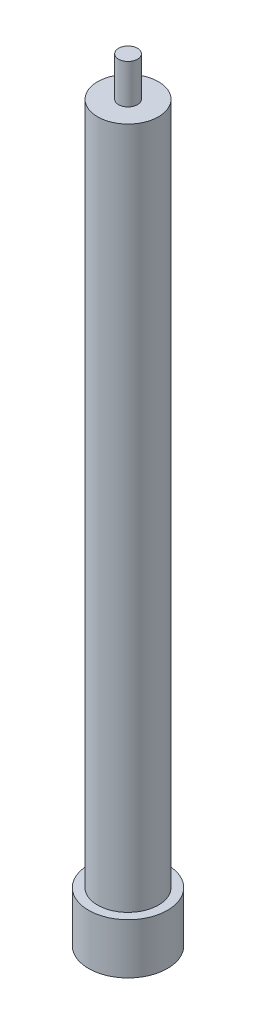
ISO-10303-21;
HEADER;
FILE_DESCRIPTION(('STEP AP214'),'2;1');
FILE_NAME('part.step','',(''),(''),'','','');
FILE_SCHEMA(('AUTOMOTIVE_DESIGN { 1 0 10303 214 1 1 1 1 }'));
ENDSEC;
DATA;
#1=APPLICATION_CONTEXT('core data for automotive mechanical design processes');
#2=APPLICATION_PROTOCOL_DEFINITION('international standard','automotive_design',2000,#1);
#3=PRODUCT_CONTEXT('',#1,'mechanical');
#4=PRODUCT('Part','Part','',(#3));
#5=PRODUCT_RELATED_PRODUCT_CATEGORY('part','',(#4));
#6=PRODUCT_DEFINITION_FORMATION('','',#4);
#7=PRODUCT_DEFINITION_CONTEXT('part definition',#1,'design');
#8=PRODUCT_DEFINITION('design','',#6,#7);
#9=PRODUCT_DEFINITION_SHAPE('','',#8);
#10=(LENGTH_UNIT() NAMED_UNIT(*) SI_UNIT(.MILLI.,.METRE.));
#11=(NAMED_UNIT(*) PLANE_ANGLE_UNIT() SI_UNIT($,.RADIAN.));
#12=(NAMED_UNIT(*) SI_UNIT($,.STERADIAN.) SOLID_ANGLE_UNIT());
#13=UNCERTAINTY_MEASURE_WITH_UNIT(LENGTH_MEASURE(1.E-05),#10,'distance_accuracy_value','');
#14=(GEOMETRIC_REPRESENTATION_CONTEXT(3) GLOBAL_UNCERTAINTY_ASSIGNED_CONTEXT((#13)) GLOBAL_UNIT_ASSIGNED_CONTEXT((#10,
#11,#12)) REPRESENTATION_CONTEXT('',''));
#15=CARTESIAN_POINT('',(0.,0.,0.));
#16=DIRECTION('',(0.,0.,1.));
#17=DIRECTION('',(1.,0.,0.));
#18=AXIS2_PLACEMENT_3D('',#15,#16,#17);
#19=CARTESIAN_POINT('',(0.,590.55,0.));
#20=DIRECTION('',(0.,-1.,0.));
#21=DIRECTION('',(0.,0.,-1.));
#22=AXIS2_PLACEMENT_3D('',#19,#20,#21);
#23=CYLINDRICAL_SURFACE('',#22,24.511);
#24=CARTESIAN_POINT('',(0.,590.55,0.));
#25=DIRECTION('',(0.,-1.,0.));
#26=DIRECTION('',(0.,0.,-1.));
#27=AXIS2_PLACEMENT_3D('',#24,#25,#26);
#28=CIRCLE('',#27,24.511);
#29=CARTESIAN_POINT('',(0.,590.55,-24.511));
#30=VERTEX_POINT('',#29);
#31=EDGE_CURVE('E51',#30,#30,#28,.T.);
#32=ORIENTED_EDGE('',*,*,#31,.T.);
#33=EDGE_LOOP('',(#32));
#34=FACE_BOUND('',#33,.T.);
#35=CARTESIAN_POINT('',(0.,40.64,0.));
#36=DIRECTION('',(0.,-1.,0.));
#37=DIRECTION('',(0.,0.,-1.));
#38=AXIS2_PLACEMENT_3D('',#35,#36,#37);
#39=CIRCLE('',#38,24.511);
#40=CARTESIAN_POINT('',(0.,40.64,-24.511));
#41=VERTEX_POINT('',#40);
#42=EDGE_CURVE('E41',#41,#41,#39,.F.);
#43=ORIENTED_EDGE('',*,*,#42,.T.);
#44=EDGE_LOOP('',(#43));
#45=FACE_BOUND('',#44,.T.);
#46=ADVANCED_FACE('F37',(#34,#45),#23,.T.);
#47=CARTESIAN_POINT('',(0.,622.3,0.));
#48=DIRECTION('',(0.,-1.,0.));
#49=DIRECTION('',(0.,0.,-1.));
#50=AXIS2_PLACEMENT_3D('',#47,#48,#49);
#51=CYLINDRICAL_SURFACE('',#50,7.62);
#52=CARTESIAN_POINT('',(0.,622.3,0.));
#53=DIRECTION('',(0.,1.,0.));
#54=DIRECTION('',(0.,0.,1.));
#55=AXIS2_PLACEMENT_3D('',#52,#53,#54);
#56=CIRCLE('',#55,7.62);
#57=CARTESIAN_POINT('',(0.,622.3,7.62));
#58=VERTEX_POINT('',#57);
#59=EDGE_CURVE('E46',#58,#58,#56,.T.);
#60=ORIENTED_EDGE('',*,*,#59,.F.);
#61=EDGE_LOOP('',(#60));
#62=FACE_BOUND('',#61,.T.);
#63=CARTESIAN_POINT('',(0.,590.55,0.));
#64=DIRECTION('',(0.,-1.,0.));
#65=DIRECTION('',(0.,0.,-1.));
#66=AXIS2_PLACEMENT_3D('',#63,#64,#65);
#67=CIRCLE('',#66,7.62);
#68=CARTESIAN_POINT('',(0.,590.55,-7.62));
#69=VERTEX_POINT('',#68);
#70=EDGE_CURVE('E10',#69,#69,#67,.T.);
#71=ORIENTED_EDGE('',*,*,#70,.F.);
#72=EDGE_LOOP('',(#71));
#73=FACE_BOUND('',#72,.T.);
#74=ADVANCED_FACE('F39',(#62,#73),#51,.T.);
#75=CARTESIAN_POINT('',(0.,622.3,0.));
#76=DIRECTION('',(0.,1.,0.));
#77=DIRECTION('',(0.,0.,1.));
#78=AXIS2_PLACEMENT_3D('',#75,#76,#77);
#79=PLANE('',#78);
#80=ORIENTED_EDGE('',*,*,#59,.T.);
#81=EDGE_LOOP('',(#80));
#82=FACE_BOUND('',#81,.T.);
#83=ADVANCED_FACE('F90',(#82),#79,.T.);
#84=CARTESIAN_POINT('',(0.,590.55,0.));
#85=DIRECTION('',(0.,-1.,0.));
#86=DIRECTION('',(0.,0.,-1.));
#87=AXIS2_PLACEMENT_3D('',#84,#85,#86);
#88=PLANE('',#87);
#89=ORIENTED_EDGE('',*,*,#70,.T.);
#90=EDGE_LOOP('',(#89));
#91=FACE_BOUND('',#90,.T.);
#92=ORIENTED_EDGE('',*,*,#31,.F.);
#93=EDGE_LOOP('',(#92));
#94=FACE_BOUND('',#93,.T.);
#95=ADVANCED_FACE('F82',(#91,#94),#88,.F.);
#96=CARTESIAN_POINT('',(0.,40.64,0.));
#97=DIRECTION('',(0.,-1.,0.));
#98=DIRECTION('',(0.,0.,-1.));
#99=AXIS2_PLACEMENT_3D('',#96,#97,#98);
#100=CYLINDRICAL_SURFACE('',#99,31.75);
#101=CARTESIAN_POINT('',(0.,40.64,0.));
#102=DIRECTION('',(0.,-1.,0.));
#103=DIRECTION('',(0.,0.,-1.));
#104=AXIS2_PLACEMENT_3D('',#101,#102,#103);
#105=CIRCLE('',#104,31.75);
#106=CARTESIAN_POINT('',(0.,40.64,-31.75));
#107=VERTEX_POINT('',#106);
#108=EDGE_CURVE('E61',#107,#107,#105,.T.);
#109=ORIENTED_EDGE('',*,*,#108,.T.);
#110=EDGE_LOOP('',(#109));
#111=FACE_BOUND('',#110,.T.);
#112=CARTESIAN_POINT('',(0.,0.,0.));
#113=DIRECTION('',(0.,-1.,0.));
#114=DIRECTION('',(0.,0.,-1.));
#115=AXIS2_PLACEMENT_3D('',#112,#113,#114);
#116=CIRCLE('',#115,31.75);
#117=CARTESIAN_POINT('',(0.,0.,-31.75));
#118=VERTEX_POINT('',#117);
#119=EDGE_CURVE('E57',#118,#118,#116,.T.);
#120=ORIENTED_EDGE('',*,*,#119,.F.);
#121=EDGE_LOOP('',(#120));
#122=FACE_BOUND('',#121,.T.);
#123=ADVANCED_FACE('F75',(#111,#122),#100,.T.);
#124=CARTESIAN_POINT('',(0.,40.64,0.));
#125=DIRECTION('',(0.,-1.,0.));
#126=DIRECTION('',(0.,0.,-1.));
#127=AXIS2_PLACEMENT_3D('',#124,#125,#126);
#128=PLANE('',#127);
#129=ORIENTED_EDGE('',*,*,#42,.F.);
#130=EDGE_LOOP('',(#129));
#131=FACE_BOUND('',#130,.T.);
#132=ORIENTED_EDGE('',*,*,#108,.F.);
#133=EDGE_LOOP('',(#132));
#134=FACE_BOUND('',#133,.T.);
#135=ADVANCED_FACE('F71',(#131,#134),#128,.F.);
#136=CARTESIAN_POINT('',(0.,0.,0.));
#137=DIRECTION('',(0.,1.,0.));
#138=DIRECTION('',(0.,0.,1.));
#139=AXIS2_PLACEMENT_3D('',#136,#137,#138);
#140=PLANE('',#139);
#141=ORIENTED_EDGE('',*,*,#119,.T.);
#142=EDGE_LOOP('',(#141));
#143=FACE_BOUND('',#142,.T.);
#144=ADVANCED_FACE('F74',(#143),#140,.F.);
#145=CLOSED_SHELL('',(#46,#74,#83,#95,#123,#135,#144));
#146=MANIFOLD_SOLID_BREP('B2',#145);
#147=ADVANCED_BREP_SHAPE_REPRESENTATION('',(#18,#146),#14);
#148=SHAPE_DEFINITION_REPRESENTATION(#9,#147);
ENDSEC;
END-ISO-10303-21;
